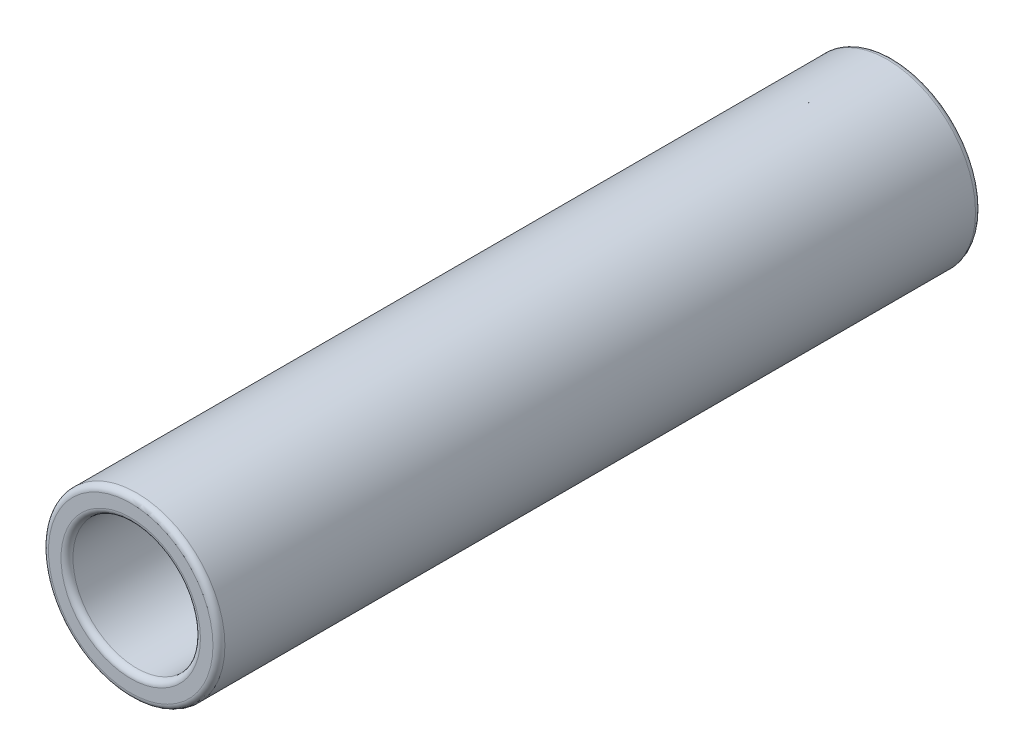
ISO-10303-21;
HEADER;
FILE_DESCRIPTION(('STEP AP214'),'2;1');
FILE_NAME('part.step','',(''),(''),'','','');
FILE_SCHEMA(('AUTOMOTIVE_DESIGN { 1 0 10303 214 1 1 1 1 }'));
ENDSEC;
DATA;
#1=APPLICATION_CONTEXT('core data for automotive mechanical design processes');
#2=APPLICATION_PROTOCOL_DEFINITION('international standard','automotive_design',2000,#1);
#3=PRODUCT_CONTEXT('',#1,'mechanical');
#4=PRODUCT('Part','Part','',(#3));
#5=PRODUCT_RELATED_PRODUCT_CATEGORY('part','',(#4));
#6=PRODUCT_DEFINITION_FORMATION('','',#4);
#7=PRODUCT_DEFINITION_CONTEXT('part definition',#1,'design');
#8=PRODUCT_DEFINITION('design','',#6,#7);
#9=PRODUCT_DEFINITION_SHAPE('','',#8);
#10=(LENGTH_UNIT() NAMED_UNIT(*) SI_UNIT(.MILLI.,.METRE.));
#11=(NAMED_UNIT(*) PLANE_ANGLE_UNIT() SI_UNIT($,.RADIAN.));
#12=(NAMED_UNIT(*) SI_UNIT($,.STERADIAN.) SOLID_ANGLE_UNIT());
#13=UNCERTAINTY_MEASURE_WITH_UNIT(LENGTH_MEASURE(1.E-05),#10,'distance_accuracy_value','');
#14=(GEOMETRIC_REPRESENTATION_CONTEXT(3) GLOBAL_UNCERTAINTY_ASSIGNED_CONTEXT((#13)) GLOBAL_UNIT_ASSIGNED_CONTEXT((#10,
#11,#12)) REPRESENTATION_CONTEXT('',''));
#15=CARTESIAN_POINT('',(0.,0.,0.));
#16=DIRECTION('',(0.,0.,1.));
#17=DIRECTION('',(1.,0.,0.));
#18=AXIS2_PLACEMENT_3D('',#15,#16,#17);
#19=CARTESIAN_POINT('',(0.,0.,0.));
#20=DIRECTION('',(0.,0.,1.));
#21=DIRECTION('',(1.,0.,0.));
#22=AXIS2_PLACEMENT_3D('',#19,#20,#21);
#23=CYLINDRICAL_SURFACE('',#22,4.26327752583068);
#24=CARTESIAN_POINT('',(0.,0.,50.6));
#25=DIRECTION('',(0.,0.,1.));
#26=DIRECTION('',(1.,0.,0.));
#27=AXIS2_PLACEMENT_3D('',#24,#25,#26);
#28=CIRCLE('',#27,4.26327752583068);
#29=CARTESIAN_POINT('',(4.26327752583068,0.,50.6));
#30=VERTEX_POINT('',#29);
#31=EDGE_CURVE('E10',#30,#30,#28,.T.);
#32=ORIENTED_EDGE('',*,*,#31,.T.);
#33=EDGE_LOOP('',(#32));
#34=FACE_BOUND('',#33,.T.);
#35=CARTESIAN_POINT('',(0.,0.,0.827940278351172));
#36=DIRECTION('',(0.,0.,-1.));
#37=DIRECTION('',(-1.,0.,0.));
#38=AXIS2_PLACEMENT_3D('',#35,#36,#37);
#39=CIRCLE('',#38,4.26327752583068);
#40=CARTESIAN_POINT('',(-4.26327752583068,0.,0.827940278351172));
#41=VERTEX_POINT('',#40);
#42=EDGE_CURVE('E38',#41,#41,#39,.F.);
#43=ORIENTED_EDGE('',*,*,#42,.F.);
#44=EDGE_LOOP('',(#43));
#45=FACE_BOUND('',#44,.T.);
#46=ADVANCED_FACE('F34',(#34,#45),#23,.F.);
#47=CARTESIAN_POINT('',(0.,0.,0.4));
#48=DIRECTION('',(0.,0.,1.));
#49=DIRECTION('',(1.,0.,0.));
#50=AXIS2_PLACEMENT_3D('',#47,#48,#49);
#51=CIRCLE('',#50,4.26327752583068);
#52=CARTESIAN_POINT('',(4.26327752583068,0.,0.4));
#53=VERTEX_POINT('',#52);
#54=EDGE_CURVE('E42',#53,#53,#51,.F.);
#55=ORIENTED_EDGE('',*,*,#54,.T.);
#56=EDGE_LOOP('',(#55));
#57=FACE_BOUND('',#56,.T.);
#58=CARTESIAN_POINT('',(0.,0.,0.590244904996363));
#59=DIRECTION('',(0.,0.,1.));
#60=DIRECTION('',(1.,0.,0.));
#61=AXIS2_PLACEMENT_3D('',#58,#59,#60);
#62=CIRCLE('',#61,4.26327752583068);
#63=CARTESIAN_POINT('',(4.26327752583068,0.,0.590244904996363));
#64=VERTEX_POINT('',#63);
#65=EDGE_CURVE('E50',#64,#64,#62,.F.);
#66=ORIENTED_EDGE('',*,*,#65,.F.);
#67=EDGE_LOOP('',(#66));
#68=FACE_BOUND('',#67,.T.);
#69=ADVANCED_FACE('F100',(#57,#68),#23,.F.);
#70=CARTESIAN_POINT('',(0.,0.,51.));
#71=DIRECTION('',(0.,0.,-1.));
#72=DIRECTION('',(-1.,0.,0.));
#73=AXIS2_PLACEMENT_3D('',#70,#71,#72);
#74=CYLINDRICAL_SURFACE('',#73,5.9);
#75=CARTESIAN_POINT('',(0.,0.,0.399999999999998));
#76=DIRECTION('',(0.,0.,1.));
#77=DIRECTION('',(1.,0.,0.));
#78=AXIS2_PLACEMENT_3D('',#75,#76,#77);
#79=CIRCLE('',#78,5.9);
#80=CARTESIAN_POINT('',(5.9,0.,0.399999999999998));
#81=VERTEX_POINT('',#80);
#82=EDGE_CURVE('E67',#81,#81,#79,.T.);
#83=ORIENTED_EDGE('',*,*,#82,.T.);
#84=EDGE_LOOP('',(#83));
#85=FACE_BOUND('',#84,.T.);
#86=CARTESIAN_POINT('',(0.,0.,50.6));
#87=DIRECTION('',(0.,0.,1.));
#88=DIRECTION('',(1.,0.,0.));
#89=AXIS2_PLACEMENT_3D('',#86,#87,#88);
#90=CIRCLE('',#89,5.9);
#91=CARTESIAN_POINT('',(5.9,0.,50.6));
#92=VERTEX_POINT('',#91);
#93=EDGE_CURVE('E56',#92,#92,#90,.F.);
#94=ORIENTED_EDGE('',*,*,#93,.T.);
#95=EDGE_LOOP('',(#94));
#96=FACE_BOUND('',#95,.T.);
#97=ADVANCED_FACE('F105',(#85,#96),#74,.T.);
#98=CARTESIAN_POINT('',(0.,0.,51.));
#99=DIRECTION('',(0.,0.,1.));
#100=DIRECTION('',(1.,0.,0.));
#101=AXIS2_PLACEMENT_3D('',#98,#99,#100);
#102=PLANE('',#101);
#103=CARTESIAN_POINT('',(0.,0.,51.));
#104=DIRECTION('',(0.,0.,1.));
#105=DIRECTION('',(1.,0.,0.));
#106=AXIS2_PLACEMENT_3D('',#103,#104,#105);
#107=CIRCLE('',#106,5.5);
#108=CARTESIAN_POINT('',(5.5,0.,51.));
#109=VERTEX_POINT('',#108);
#110=EDGE_CURVE('E47',#109,#109,#107,.T.);
#111=ORIENTED_EDGE('',*,*,#110,.T.);
#112=EDGE_LOOP('',(#111));
#113=FACE_BOUND('',#112,.T.);
#114=CARTESIAN_POINT('',(0.,0.,51.));
#115=DIRECTION('',(0.,0.,1.));
#116=DIRECTION('',(1.,0.,0.));
#117=AXIS2_PLACEMENT_3D('',#114,#115,#116);
#118=CIRCLE('',#117,4.66327752583068);
#119=CARTESIAN_POINT('',(4.66327752583068,0.,51.));
#120=VERTEX_POINT('',#119);
#121=EDGE_CURVE('E76',#120,#120,#118,.F.);
#122=ORIENTED_EDGE('',*,*,#121,.T.);
#123=EDGE_LOOP('',(#122));
#124=FACE_BOUND('',#123,.T.);
#125=ADVANCED_FACE('F81',(#113,#124),#102,.T.);
#126=CARTESIAN_POINT('',(0.,0.,0.));
#127=DIRECTION('',(0.,0.,1.));
#128=DIRECTION('',(1.,0.,0.));
#129=AXIS2_PLACEMENT_3D('',#126,#127,#128);
#130=PLANE('',#129);
#131=CARTESIAN_POINT('',(0.,0.,0.));
#132=DIRECTION('',(0.,0.,1.));
#133=DIRECTION('',(1.,0.,0.));
#134=AXIS2_PLACEMENT_3D('',#131,#132,#133);
#135=CIRCLE('',#134,5.5);
#136=CARTESIAN_POINT('',(5.5,0.,0.));
#137=VERTEX_POINT('',#136);
#138=EDGE_CURVE('E73',#137,#137,#135,.F.);
#139=ORIENTED_EDGE('',*,*,#138,.T.);
#140=EDGE_LOOP('',(#139));
#141=FACE_BOUND('',#140,.T.);
#142=CARTESIAN_POINT('',(0.,0.,0.));
#143=DIRECTION('',(0.,0.,1.));
#144=DIRECTION('',(1.,0.,0.));
#145=AXIS2_PLACEMENT_3D('',#142,#143,#144);
#146=CIRCLE('',#145,4.66327752583068);
#147=CARTESIAN_POINT('',(4.66327752583068,0.,0.));
#148=VERTEX_POINT('',#147);
#149=EDGE_CURVE('E70',#148,#148,#146,.T.);
#150=ORIENTED_EDGE('',*,*,#149,.T.);
#151=EDGE_LOOP('',(#150));
#152=FACE_BOUND('',#151,.T.);
#153=ADVANCED_FACE('F95',(#141,#152),#130,.F.);
#154=CARTESIAN_POINT('',(0.,0.,0.399999999999998));
#155=DIRECTION('',(0.,0.,1.));
#156=DIRECTION('',(1.,0.,0.));
#157=AXIS2_PLACEMENT_3D('',#154,#155,#156);
#158=TOROIDAL_SURFACE('',#157,5.5,0.4);
#159=ORIENTED_EDGE('',*,*,#138,.F.);
#160=EDGE_LOOP('',(#159));
#161=FACE_BOUND('',#160,.T.);
#162=ORIENTED_EDGE('',*,*,#82,.F.);
#163=EDGE_LOOP('',(#162));
#164=FACE_BOUND('',#163,.T.);
#165=ADVANCED_FACE('F87',(#161,#164),#158,.T.);
#166=CARTESIAN_POINT('',(0.,0.,50.6));
#167=DIRECTION('',(0.,0.,1.));
#168=DIRECTION('',(1.,0.,0.));
#169=AXIS2_PLACEMENT_3D('',#166,#167,#168);
#170=TOROIDAL_SURFACE('',#169,5.5,0.4);
#171=ORIENTED_EDGE('',*,*,#93,.F.);
#172=EDGE_LOOP('',(#171));
#173=FACE_BOUND('',#172,.T.);
#174=ORIENTED_EDGE('',*,*,#110,.F.);
#175=EDGE_LOOP('',(#174));
#176=FACE_BOUND('',#175,.T.);
#177=ADVANCED_FACE('F84',(#173,#176),#170,.T.);
#178=CARTESIAN_POINT('',(0.,0.,50.6));
#179=DIRECTION('',(0.,0.,1.));
#180=DIRECTION('',(1.,0.,0.));
#181=AXIS2_PLACEMENT_3D('',#178,#179,#180);
#182=TOROIDAL_SURFACE('',#181,4.66327752583068,0.4);
#183=ORIENTED_EDGE('',*,*,#121,.F.);
#184=EDGE_LOOP('',(#183));
#185=FACE_BOUND('',#184,.T.);
#186=ORIENTED_EDGE('',*,*,#31,.F.);
#187=EDGE_LOOP('',(#186));
#188=FACE_BOUND('',#187,.T.);
#189=ADVANCED_FACE('F86',(#185,#188),#182,.T.);
#190=CARTESIAN_POINT('',(0.,0.,0.4));
#191=DIRECTION('',(0.,0.,1.));
#192=DIRECTION('',(1.,0.,0.));
#193=AXIS2_PLACEMENT_3D('',#190,#191,#192);
#194=TOROIDAL_SURFACE('',#193,4.66327752583068,0.4);
#195=ORIENTED_EDGE('',*,*,#54,.F.);
#196=EDGE_LOOP('',(#195));
#197=FACE_BOUND('',#196,.T.);
#198=ORIENTED_EDGE('',*,*,#149,.F.);
#199=EDGE_LOOP('',(#198));
#200=FACE_BOUND('',#199,.T.);
#201=ADVANCED_FACE('F36',(#197,#200),#194,.T.);
#202=CARTESIAN_POINT('',(-4.40385072879128,0.,0.827940278351172));
#203=DIRECTION('',(0.,0.,-1.));
#204=DIRECTION('',(-1.,0.,0.));
#205=AXIS2_PLACEMENT_3D('',#202,#203,#204);
#206=PLANE('',#205);
#207=CARTESIAN_POINT('',(0.,0.,0.827940278351172));
#208=DIRECTION('',(0.,0.,1.));
#209=DIRECTION('',(1.,0.,0.));
#210=AXIS2_PLACEMENT_3D('',#207,#208,#209);
#211=CIRCLE('',#210,4.40385072879128);
#212=CARTESIAN_POINT('',(4.40385072879128,0.,0.827940278351172));
#213=VERTEX_POINT('',#212);
#214=EDGE_CURVE('E52',#213,#213,#211,.T.);
#215=ORIENTED_EDGE('',*,*,#214,.F.);
#216=EDGE_LOOP('',(#215));
#217=FACE_BOUND('',#216,.T.);
#218=ORIENTED_EDGE('',*,*,#42,.T.);
#219=EDGE_LOOP('',(#218));
#220=FACE_BOUND('',#219,.T.);
#221=ADVANCED_FACE('F157',(#217,#220),#206,.T.);
#222=CARTESIAN_POINT('',(-4.40385072879128,0.,0.590244904996363));
#223=DIRECTION('',(0.,0.,1.));
#224=DIRECTION('',(1.,0.,0.));
#225=AXIS2_PLACEMENT_3D('',#222,#223,#224);
#226=PLANE('',#225);
#227=CARTESIAN_POINT('',(0.,0.,0.590244904996363));
#228=DIRECTION('',(0.,0.,1.));
#229=DIRECTION('',(1.,0.,0.));
#230=AXIS2_PLACEMENT_3D('',#227,#228,#229);
#231=CIRCLE('',#230,4.40385072879128);
#232=CARTESIAN_POINT('',(4.40385072879128,0.,0.590244904996363));
#233=VERTEX_POINT('',#232);
#234=EDGE_CURVE('E58',#233,#233,#231,.T.);
#235=ORIENTED_EDGE('',*,*,#234,.T.);
#236=EDGE_LOOP('',(#235));
#237=FACE_BOUND('',#236,.T.);
#238=ORIENTED_EDGE('',*,*,#65,.T.);
#239=EDGE_LOOP('',(#238));
#240=FACE_BOUND('',#239,.T.);
#241=ADVANCED_FACE('F176',(#237,#240),#226,.T.);
#242=CARTESIAN_POINT('',(0.,0.,0.4));
#243=DIRECTION('',(0.,0.,1.));
#244=DIRECTION('',(1.,0.,0.));
#245=AXIS2_PLACEMENT_3D('',#242,#243,#244);
#246=CYLINDRICAL_SURFACE('',#245,4.40385072879128);
#247=ORIENTED_EDGE('',*,*,#214,.T.);
#248=EDGE_LOOP('',(#247));
#249=FACE_BOUND('',#248,.T.);
#250=ORIENTED_EDGE('',*,*,#234,.F.);
#251=EDGE_LOOP('',(#250));
#252=FACE_BOUND('',#251,.T.);
#253=ADVANCED_FACE('F110',(#249,#252),#246,.F.);
#254=CLOSED_SHELL('',(#46,#69,#97,#125,#153,#165,#177,#189,#201,#221,#241,#253));
#255=MANIFOLD_SOLID_BREP('B2',#254);
#256=ADVANCED_BREP_SHAPE_REPRESENTATION('',(#18,#255),#14);
#257=SHAPE_DEFINITION_REPRESENTATION(#9,#256);
ENDSEC;
END-ISO-10303-21;
